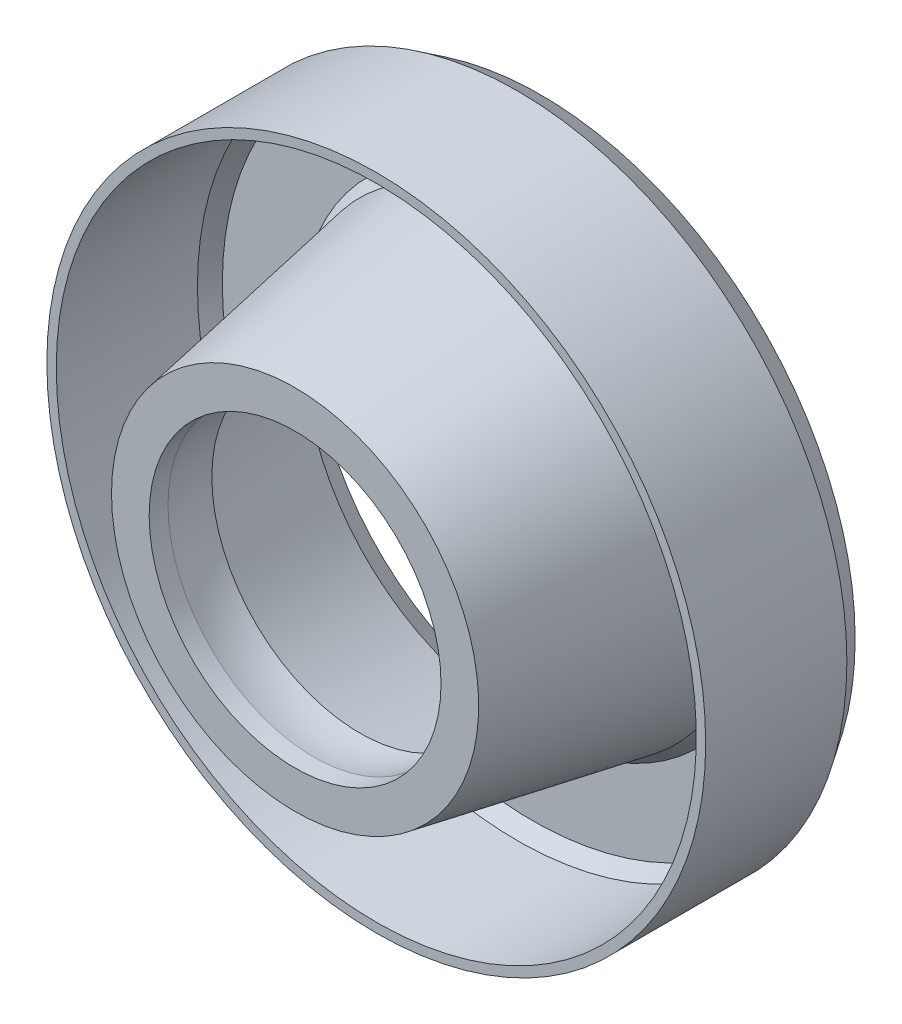
ISO-10303-21;
HEADER;
FILE_DESCRIPTION(('STEP AP214'),'2;1');
FILE_NAME('part.step','',(''),(''),'','','');
FILE_SCHEMA(('AUTOMOTIVE_DESIGN { 1 0 10303 214 1 1 1 1 }'));
ENDSEC;
DATA;
#1=APPLICATION_CONTEXT('core data for automotive mechanical design processes');
#2=APPLICATION_PROTOCOL_DEFINITION('international standard','automotive_design',2000,#1);
#3=PRODUCT_CONTEXT('',#1,'mechanical');
#4=PRODUCT('Part','Part','',(#3));
#5=PRODUCT_RELATED_PRODUCT_CATEGORY('part','',(#4));
#6=PRODUCT_DEFINITION_FORMATION('','',#4);
#7=PRODUCT_DEFINITION_CONTEXT('part definition',#1,'design');
#8=PRODUCT_DEFINITION('design','',#6,#7);
#9=PRODUCT_DEFINITION_SHAPE('','',#8);
#10=(LENGTH_UNIT() NAMED_UNIT(*) SI_UNIT(.MILLI.,.METRE.));
#11=(NAMED_UNIT(*) PLANE_ANGLE_UNIT() SI_UNIT($,.RADIAN.));
#12=(NAMED_UNIT(*) SI_UNIT($,.STERADIAN.) SOLID_ANGLE_UNIT());
#13=UNCERTAINTY_MEASURE_WITH_UNIT(LENGTH_MEASURE(1.E-05),#10,'distance_accuracy_value','');
#14=(GEOMETRIC_REPRESENTATION_CONTEXT(3) GLOBAL_UNCERTAINTY_ASSIGNED_CONTEXT((#13)) GLOBAL_UNIT_ASSIGNED_CONTEXT((#10,
#11,#12)) REPRESENTATION_CONTEXT('',''));
#15=CARTESIAN_POINT('',(0.,0.,0.));
#16=DIRECTION('',(0.,0.,1.));
#17=DIRECTION('',(1.,0.,0.));
#18=AXIS2_PLACEMENT_3D('',#15,#16,#17);
#19=CARTESIAN_POINT('',(24.0666666666667,0.,-10.3459887560136));
#20=DIRECTION('',(0.,0.,-1.));
#21=DIRECTION('',(-1.,0.,0.));
#22=AXIS2_PLACEMENT_3D('',#19,#20,#21);
#23=CYLINDRICAL_SURFACE('',#22,35.);
#24=CARTESIAN_POINT('',(24.0666666666667,0.,10.9666666666667));
#25=DIRECTION('',(0.,0.,-1.));
#26=DIRECTION('',(-1.,0.,0.));
#27=AXIS2_PLACEMENT_3D('',#24,#25,#26);
#28=CIRCLE('',#27,35.);
#29=CARTESIAN_POINT('',(-10.9333333333333,0.,10.9666666666667));
#30=VERTEX_POINT('',#29);
#31=EDGE_CURVE('E10',#30,#30,#28,.T.);
#32=ORIENTED_EDGE('',*,*,#31,.T.);
#33=EDGE_LOOP('',(#32));
#34=FACE_BOUND('',#33,.T.);
#35=CARTESIAN_POINT('',(24.0666666666667,0.,-4.03333333333334));
#36=DIRECTION('',(0.,0.,-1.));
#37=DIRECTION('',(-1.,0.,0.));
#38=AXIS2_PLACEMENT_3D('',#35,#36,#37);
#39=CIRCLE('',#38,35.);
#40=CARTESIAN_POINT('',(-10.9333333333333,0.,-4.03333333333333));
#41=VERTEX_POINT('',#40);
#42=EDGE_CURVE('E83',#41,#41,#39,.T.);
#43=ORIENTED_EDGE('',*,*,#42,.F.);
#44=EDGE_LOOP('',(#43));
#45=FACE_BOUND('',#44,.T.);
#46=ADVANCED_FACE('F34',(#34,#45),#23,.T.);
#47=CARTESIAN_POINT('',(-10.9333333333333,0.,10.9666666666667));
#48=DIRECTION('',(0.,0.,1.));
#49=DIRECTION('',(1.,0.,0.));
#50=AXIS2_PLACEMENT_3D('',#47,#48,#49);
#51=PLANE('',#50);
#52=CARTESIAN_POINT('',(24.0666666666667,0.,10.9666666666667));
#53=DIRECTION('',(0.,0.,-1.));
#54=DIRECTION('',(-1.,0.,0.));
#55=AXIS2_PLACEMENT_3D('',#52,#53,#54);
#56=CIRCLE('',#55,34.);
#57=CARTESIAN_POINT('',(-9.93333333333333,0.,10.9666666666667));
#58=VERTEX_POINT('',#57);
#59=EDGE_CURVE('E40',#58,#58,#56,.T.);
#60=ORIENTED_EDGE('',*,*,#59,.T.);
#61=EDGE_LOOP('',(#60));
#62=FACE_BOUND('',#61,.T.);
#63=ORIENTED_EDGE('',*,*,#31,.F.);
#64=EDGE_LOOP('',(#63));
#65=FACE_BOUND('',#64,.T.);
#66=ADVANCED_FACE('F91',(#62,#65),#51,.T.);
#67=CARTESIAN_POINT('',(24.0666666666667,0.,-10.3459887560136));
#68=DIRECTION('',(0.,0.,-1.));
#69=DIRECTION('',(-1.,0.,0.));
#70=AXIS2_PLACEMENT_3D('',#67,#68,#69);
#71=CYLINDRICAL_SURFACE('',#70,34.);
#72=CARTESIAN_POINT('',(24.0666666666667,0.,-4.03333333333334));
#73=DIRECTION('',(0.,0.,-1.));
#74=DIRECTION('',(-1.,0.,0.));
#75=AXIS2_PLACEMENT_3D('',#72,#73,#74);
#76=CIRCLE('',#75,34.);
#77=CARTESIAN_POINT('',(-9.93333333333333,0.,-4.03333333333333));
#78=VERTEX_POINT('',#77);
#79=EDGE_CURVE('E44',#78,#78,#76,.T.);
#80=ORIENTED_EDGE('',*,*,#79,.T.);
#81=EDGE_LOOP('',(#80));
#82=FACE_BOUND('',#81,.T.);
#83=ORIENTED_EDGE('',*,*,#59,.F.);
#84=EDGE_LOOP('',(#83));
#85=FACE_BOUND('',#84,.T.);
#86=ADVANCED_FACE('F95',(#82,#85),#71,.F.);
#87=CARTESIAN_POINT('',(24.0666666666667,0.,-4.03333333333334));
#88=DIRECTION('',(0.,0.,1.));
#89=DIRECTION('',(1.,0.,0.));
#90=AXIS2_PLACEMENT_3D('',#87,#88,#89);
#91=CONICAL_SURFACE('',#90,34.,0.576975918344578);
#92=CARTESIAN_POINT('',(24.0666666666667,0.,-5.63491013039277));
#93=DIRECTION('',(0.,0.,-1.));
#94=DIRECTION('',(-1.,0.,0.));
#95=AXIS2_PLACEMENT_3D('',#92,#93,#94);
#96=CIRCLE('',#95,32.9576060117403);
#97=CARTESIAN_POINT('',(-8.89093934507366,0.,-5.63491013039277));
#98=VERTEX_POINT('',#97);
#99=EDGE_CURVE('E48',#98,#98,#96,.T.);
#100=ORIENTED_EDGE('',*,*,#99,.T.);
#101=EDGE_LOOP('',(#100));
#102=FACE_BOUND('',#101,.T.);
#103=ORIENTED_EDGE('',*,*,#79,.F.);
#104=EDGE_LOOP('',(#103));
#105=FACE_BOUND('',#104,.T.);
#106=ADVANCED_FACE('F99',(#102,#105),#91,.F.);
#107=CARTESIAN_POINT('',(-8.89093934507366,0.,-5.63491013039276));
#108=DIRECTION('',(0.,0.,1.));
#109=DIRECTION('',(1.,0.,0.));
#110=AXIS2_PLACEMENT_3D('',#107,#108,#109);
#111=PLANE('',#110);
#112=CARTESIAN_POINT('',(24.0666666666667,0.,-5.63491013039277));
#113=DIRECTION('',(0.,0.,-1.));
#114=DIRECTION('',(-1.,0.,0.));
#115=AXIS2_PLACEMENT_3D('',#112,#113,#114);
#116=CIRCLE('',#115,24.7694425676461);
#117=CARTESIAN_POINT('',(-0.70277590097946,0.,-5.63491013039277));
#118=VERTEX_POINT('',#117);
#119=EDGE_CURVE('E53',#118,#118,#116,.T.);
#120=ORIENTED_EDGE('',*,*,#119,.T.);
#121=EDGE_LOOP('',(#120));
#122=FACE_BOUND('',#121,.T.);
#123=ORIENTED_EDGE('',*,*,#99,.F.);
#124=EDGE_LOOP('',(#123));
#125=FACE_BOUND('',#124,.T.);
#126=ADVANCED_FACE('F106',(#122,#125),#111,.T.);
#127=CARTESIAN_POINT('',(24.0666666666667,0.,-5.63491013039277));
#128=DIRECTION('',(0.,0.,-1.));
#129=DIRECTION('',(-1.,0.,0.));
#130=AXIS2_PLACEMENT_3D('',#127,#128,#129);
#131=CONICAL_SURFACE('',#130,24.7694425676461,0.576975918344578);
#132=CARTESIAN_POINT('',(24.0666666666667,0.,-4.03333333333333));
#133=DIRECTION('',(0.,0.,-1.));
#134=DIRECTION('',(-1.,0.,0.));
#135=AXIS2_PLACEMENT_3D('',#132,#133,#134);
#136=CIRCLE('',#135,23.7270485793865);
#137=CARTESIAN_POINT('',(0.339618087280211,0.,-4.03333333333333));
#138=VERTEX_POINT('',#137);
#139=EDGE_CURVE('E56',#138,#138,#136,.T.);
#140=ORIENTED_EDGE('',*,*,#139,.T.);
#141=EDGE_LOOP('',(#140));
#142=FACE_BOUND('',#141,.T.);
#143=ORIENTED_EDGE('',*,*,#119,.F.);
#144=EDGE_LOOP('',(#143));
#145=FACE_BOUND('',#144,.T.);
#146=ADVANCED_FACE('F110',(#142,#145),#131,.T.);
#147=CARTESIAN_POINT('',(24.0666666666667,0.,-4.03333333333333));
#148=DIRECTION('',(0.,0.,-1.));
#149=DIRECTION('',(-1.,0.,0.));
#150=AXIS2_PLACEMENT_3D('',#147,#148,#149);
#151=CONICAL_SURFACE('',#150,23.7270485793865,0.176860528457524);
#152=CARTESIAN_POINT('',(24.0666666666667,0.,19.5922883050573));
#153=DIRECTION('',(0.,0.,-1.));
#154=DIRECTION('',(-1.,0.,0.));
#155=AXIS2_PLACEMENT_3D('',#152,#153,#154);
#156=CIRCLE('',#155,19.5044898527837);
#157=CARTESIAN_POINT('',(4.56217681388297,0.,19.5922883050573));
#158=VERTEX_POINT('',#157);
#159=EDGE_CURVE('E59',#158,#158,#156,.T.);
#160=ORIENTED_EDGE('',*,*,#159,.T.);
#161=EDGE_LOOP('',(#160));
#162=FACE_BOUND('',#161,.T.);
#163=ORIENTED_EDGE('',*,*,#139,.F.);
#164=EDGE_LOOP('',(#163));
#165=FACE_BOUND('',#164,.T.);
#166=ADVANCED_FACE('F114',(#162,#165),#151,.T.);
#167=CARTESIAN_POINT('',(4.56217681388297,0.,19.5922883050573));
#168=DIRECTION('',(0.,0.,1.));
#169=DIRECTION('',(1.,0.,0.));
#170=AXIS2_PLACEMENT_3D('',#167,#168,#169);
#171=PLANE('',#170);
#172=CARTESIAN_POINT('',(24.0666666666667,0.,19.5922883050573));
#173=DIRECTION('',(0.,0.,-1.));
#174=DIRECTION('',(-1.,0.,0.));
#175=AXIS2_PLACEMENT_3D('',#172,#173,#174);
#176=CIRCLE('',#175,15.5044898527837);
#177=CARTESIAN_POINT('',(8.56217681388297,0.,19.5922883050573));
#178=VERTEX_POINT('',#177);
#179=EDGE_CURVE('E62',#178,#178,#176,.T.);
#180=ORIENTED_EDGE('',*,*,#179,.T.);
#181=EDGE_LOOP('',(#180));
#182=FACE_BOUND('',#181,.T.);
#183=ORIENTED_EDGE('',*,*,#159,.F.);
#184=EDGE_LOOP('',(#183));
#185=FACE_BOUND('',#184,.T.);
#186=ADVANCED_FACE('F118',(#182,#185),#171,.T.);
#187=CARTESIAN_POINT('',(24.0666666666667,0.,-10.3459887560136));
#188=DIRECTION('',(0.,0.,-1.));
#189=DIRECTION('',(-1.,0.,0.));
#190=AXIS2_PLACEMENT_3D('',#187,#188,#189);
#191=CYLINDRICAL_SURFACE('',#190,15.5044898527837);
#192=CARTESIAN_POINT('',(24.0666666666667,0.,17.5922883050573));
#193=DIRECTION('',(0.,0.,-1.));
#194=DIRECTION('',(-1.,0.,0.));
#195=AXIS2_PLACEMENT_3D('',#192,#193,#194);
#196=CIRCLE('',#195,15.5044898527837);
#197=CARTESIAN_POINT('',(8.56217681388297,0.,17.5922883050573));
#198=VERTEX_POINT('',#197);
#199=EDGE_CURVE('E65',#198,#198,#196,.T.);
#200=ORIENTED_EDGE('',*,*,#199,.T.);
#201=EDGE_LOOP('',(#200));
#202=FACE_BOUND('',#201,.T.);
#203=ORIENTED_EDGE('',*,*,#179,.F.);
#204=EDGE_LOOP('',(#203));
#205=FACE_BOUND('',#204,.T.);
#206=ADVANCED_FACE('F122',(#202,#205),#191,.F.);
#207=CARTESIAN_POINT('',(24.0666666666667,0.,14.4072650676879));
#208=DIRECTION('',(0.,0.,-1.));
#209=DIRECTION('',(-1.,0.,0.));
#210=AXIS2_PLACEMENT_3D('',#207,#208,#209);
#211=SPHERICAL_SURFACE('',#210,15.8282525446638);
#212=CARTESIAN_POINT('',(24.0666666666667,0.,12.70148199386));
#213=DIRECTION('',(0.,0.,-1.));
#214=DIRECTION('',(-1.,0.,0.));
#215=AXIS2_PLACEMENT_3D('',#212,#213,#214);
#216=CIRCLE('',#215,15.7360694813762);
#217=CARTESIAN_POINT('',(8.3305971852905,0.,12.70148199386));
#218=VERTEX_POINT('',#217);
#219=EDGE_CURVE('E68',#218,#218,#216,.T.);
#220=ORIENTED_EDGE('',*,*,#219,.T.);
#221=EDGE_LOOP('',(#220));
#222=FACE_BOUND('',#221,.T.);
#223=ORIENTED_EDGE('',*,*,#199,.F.);
#224=EDGE_LOOP('',(#223));
#225=FACE_BOUND('',#224,.T.);
#226=ADVANCED_FACE('F126',(#222,#225),#211,.F.);
#227=CARTESIAN_POINT('',(4.3305971852905,0.,12.70148199386));
#228=DIRECTION('',(0.,0.,-1.));
#229=DIRECTION('',(-1.,0.,0.));
#230=AXIS2_PLACEMENT_3D('',#227,#228,#229);
#231=PLANE('',#230);
#232=CARTESIAN_POINT('',(24.0666666666667,0.,12.70148199386));
#233=DIRECTION('',(0.,0.,-1.));
#234=DIRECTION('',(-1.,0.,0.));
#235=AXIS2_PLACEMENT_3D('',#232,#233,#234);
#236=CIRCLE('',#235,19.7360694813762);
#237=CARTESIAN_POINT('',(4.3305971852905,0.,12.70148199386));
#238=VERTEX_POINT('',#237);
#239=EDGE_CURVE('E71',#238,#238,#236,.T.);
#240=ORIENTED_EDGE('',*,*,#239,.T.);
#241=EDGE_LOOP('',(#240));
#242=FACE_BOUND('',#241,.T.);
#243=ORIENTED_EDGE('',*,*,#219,.F.);
#244=EDGE_LOOP('',(#243));
#245=FACE_BOUND('',#244,.T.);
#246=ADVANCED_FACE('F130',(#242,#245),#231,.T.);
#247=CARTESIAN_POINT('',(24.0666666666667,0.,12.70148199386));
#248=DIRECTION('',(0.,0.,-1.));
#249=DIRECTION('',(-1.,0.,0.));
#250=AXIS2_PLACEMENT_3D('',#247,#248,#249);
#251=CONICAL_SURFACE('',#250,19.7360694813762,0.176860528457524);
#252=CARTESIAN_POINT('',(24.0666666666667,0.,-4.03333333333334));
#253=DIRECTION('',(0.,0.,-1.));
#254=DIRECTION('',(-1.,0.,0.));
#255=AXIS2_PLACEMENT_3D('',#252,#253,#254);
#256=CIRCLE('',#255,22.7270485793865);
#257=CARTESIAN_POINT('',(1.33961808728021,0.,-4.03333333333333));
#258=VERTEX_POINT('',#257);
#259=EDGE_CURVE('E74',#258,#258,#256,.T.);
#260=ORIENTED_EDGE('',*,*,#259,.T.);
#261=EDGE_LOOP('',(#260));
#262=FACE_BOUND('',#261,.T.);
#263=ORIENTED_EDGE('',*,*,#239,.F.);
#264=EDGE_LOOP('',(#263));
#265=FACE_BOUND('',#264,.T.);
#266=ADVANCED_FACE('F134',(#262,#265),#251,.F.);
#267=CARTESIAN_POINT('',(24.0666666666667,0.,-4.03333333333334));
#268=DIRECTION('',(0.,0.,-1.));
#269=DIRECTION('',(-1.,0.,0.));
#270=AXIS2_PLACEMENT_3D('',#267,#268,#269);
#271=CONICAL_SURFACE('',#270,22.7270485793865,0.576975918344577);
#272=CARTESIAN_POINT('',(24.0666666666667,0.,-6.54768160864763));
#273=DIRECTION('',(0.,0.,-1.));
#274=DIRECTION('',(-1.,0.,0.));
#275=AXIS2_PLACEMENT_3D('',#272,#273,#274);
#276=CIRCLE('',#275,24.3635242896932);
#277=CARTESIAN_POINT('',(-0.296857623026558,0.,-6.54768160864762));
#278=VERTEX_POINT('',#277);
#279=EDGE_CURVE('E77',#278,#278,#276,.T.);
#280=ORIENTED_EDGE('',*,*,#279,.T.);
#281=EDGE_LOOP('',(#280));
#282=FACE_BOUND('',#281,.T.);
#283=ORIENTED_EDGE('',*,*,#259,.F.);
#284=EDGE_LOOP('',(#283));
#285=FACE_BOUND('',#284,.T.);
#286=ADVANCED_FACE('F138',(#282,#285),#271,.F.);
#287=CARTESIAN_POINT('',(-9.29685762302656,0.,-6.54768160864762));
#288=DIRECTION('',(0.,0.,-1.));
#289=DIRECTION('',(-1.,0.,0.));
#290=AXIS2_PLACEMENT_3D('',#287,#288,#289);
#291=PLANE('',#290);
#292=CARTESIAN_POINT('',(24.0666666666667,0.,-6.54768160864763));
#293=DIRECTION('',(0.,0.,-1.));
#294=DIRECTION('',(-1.,0.,0.));
#295=AXIS2_PLACEMENT_3D('',#292,#293,#294);
#296=CIRCLE('',#295,33.3635242896932);
#297=CARTESIAN_POINT('',(-9.29685762302656,0.,-6.54768160864762));
#298=VERTEX_POINT('',#297);
#299=EDGE_CURVE('E80',#298,#298,#296,.T.);
#300=ORIENTED_EDGE('',*,*,#299,.T.);
#301=EDGE_LOOP('',(#300));
#302=FACE_BOUND('',#301,.T.);
#303=ORIENTED_EDGE('',*,*,#279,.F.);
#304=EDGE_LOOP('',(#303));
#305=FACE_BOUND('',#304,.T.);
#306=ADVANCED_FACE('F142',(#302,#305),#291,.T.);
#307=CARTESIAN_POINT('',(24.0666666666667,0.,-6.54768160864763));
#308=DIRECTION('',(0.,0.,1.));
#309=DIRECTION('',(1.,0.,0.));
#310=AXIS2_PLACEMENT_3D('',#307,#308,#309);
#311=CONICAL_SURFACE('',#310,33.3635242896932,0.576975918344577);
#312=ORIENTED_EDGE('',*,*,#42,.T.);
#313=EDGE_LOOP('',(#312));
#314=FACE_BOUND('',#313,.T.);
#315=ORIENTED_EDGE('',*,*,#299,.F.);
#316=EDGE_LOOP('',(#315));
#317=FACE_BOUND('',#316,.T.);
#318=ADVANCED_FACE('F87',(#314,#317),#311,.T.);
#319=CLOSED_SHELL('',(#46,#66,#86,#106,#126,#146,#166,#186,#206,#226,#246,#266,#286,#306,#318));
#320=MANIFOLD_SOLID_BREP('B2',#319);
#321=ADVANCED_BREP_SHAPE_REPRESENTATION('',(#18,#320),#14);
#322=SHAPE_DEFINITION_REPRESENTATION(#9,#321);
ENDSEC;
END-ISO-10303-21;
